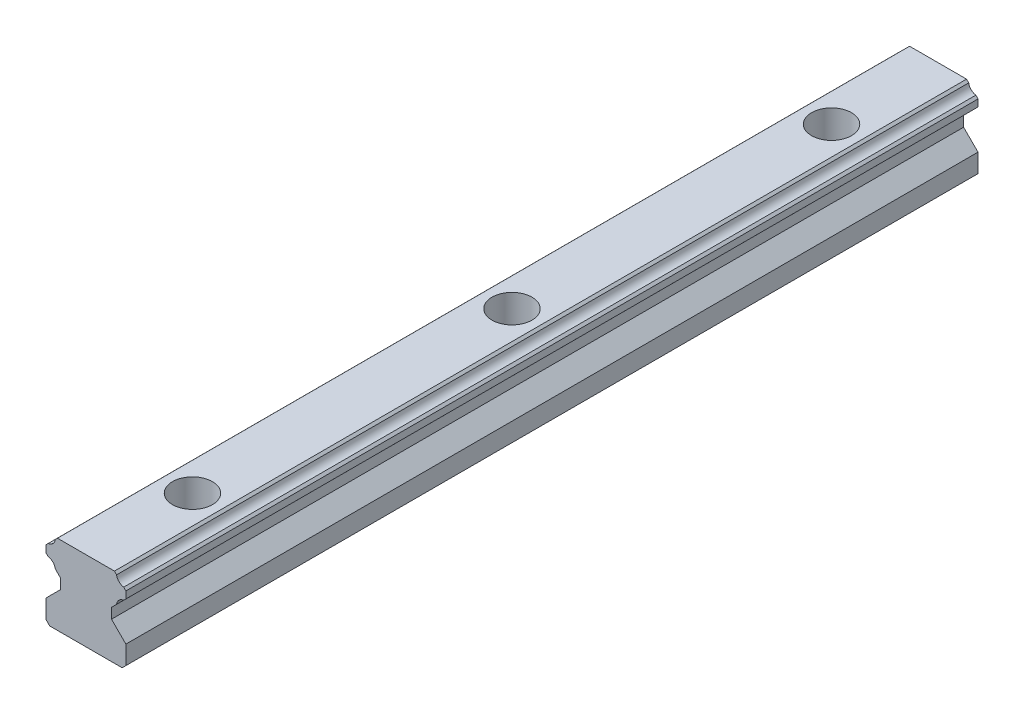
ISO-10303-21;
HEADER;
FILE_DESCRIPTION(('STEP AP214'),'2;1');
FILE_NAME('part.step','',(''),(''),'','','');
FILE_SCHEMA(('AUTOMOTIVE_DESIGN { 1 0 10303 214 1 1 1 1 }'));
ENDSEC;
DATA;
#1=APPLICATION_CONTEXT('core data for automotive mechanical design processes');
#2=APPLICATION_PROTOCOL_DEFINITION('international standard','automotive_design',2000,#1);
#3=PRODUCT_CONTEXT('',#1,'mechanical');
#4=PRODUCT('Part','Part','',(#3));
#5=PRODUCT_RELATED_PRODUCT_CATEGORY('part','',(#4));
#6=PRODUCT_DEFINITION_FORMATION('','',#4);
#7=PRODUCT_DEFINITION_CONTEXT('part definition',#1,'design');
#8=PRODUCT_DEFINITION('design','',#6,#7);
#9=PRODUCT_DEFINITION_SHAPE('','',#8);
#10=(LENGTH_UNIT() NAMED_UNIT(*) SI_UNIT(.MILLI.,.METRE.));
#11=(NAMED_UNIT(*) PLANE_ANGLE_UNIT() SI_UNIT($,.RADIAN.));
#12=(NAMED_UNIT(*) SI_UNIT($,.STERADIAN.) SOLID_ANGLE_UNIT());
#13=UNCERTAINTY_MEASURE_WITH_UNIT(LENGTH_MEASURE(1.E-05),#10,'distance_accuracy_value','');
#14=(GEOMETRIC_REPRESENTATION_CONTEXT(3) GLOBAL_UNCERTAINTY_ASSIGNED_CONTEXT((#13)) GLOBAL_UNIT_ASSIGNED_CONTEXT((#10,
#11,#12)) REPRESENTATION_CONTEXT('',''));
#15=CARTESIAN_POINT('',(0.,0.,0.));
#16=DIRECTION('',(0.,0.,1.));
#17=DIRECTION('',(1.,0.,0.));
#18=AXIS2_PLACEMENT_3D('',#15,#16,#17);
#19=CARTESIAN_POINT('',(5.3500197001096,15.,-160.));
#20=DIRECTION('',(0.,1.,0.));
#21=DIRECTION('',(-1.,0.,0.));
#22=AXIS2_PLACEMENT_3D('',#19,#20,#21);
#23=PLANE('',#22);
#24=CARTESIAN_POINT('',(0.,15.,-80.));
#25=DIRECTION('',(0.,1.,0.));
#26=DIRECTION('',(0.,0.,1.));
#27=AXIS2_PLACEMENT_3D('',#24,#25,#26);
#28=CIRCLE('',#27,3.75000000000001);
#29=CARTESIAN_POINT('',(0.,15.,-76.25));
#30=VERTEX_POINT('',#29);
#31=EDGE_CURVE('E482',#30,#30,#28,.T.);
#32=ORIENTED_EDGE('',*,*,#31,.F.);
#33=EDGE_LOOP('',(#32));
#34=FACE_BOUND('',#33,.T.);
#35=DIRECTION('',(-1.,0.,0.));
#36=VECTOR('',#35,1.);
#37=CARTESIAN_POINT('',(5.3500197001096,15.,0.));
#38=LINE('',#37,#36);
#39=CARTESIAN_POINT('',(5.3500197001096,15.,0.));
#40=VERTEX_POINT('',#39);
#41=CARTESIAN_POINT('',(-5.3500197001096,15.,0.));
#42=VERTEX_POINT('',#41);
#43=EDGE_CURVE('E273',#40,#42,#38,.T.);
#44=ORIENTED_EDGE('',*,*,#43,.F.);
#45=DIRECTION('',(0.,0.,1.));
#46=VECTOR('',#45,1.);
#47=CARTESIAN_POINT('',(5.3500197001096,15.,-160.));
#48=LINE('',#47,#46);
#49=CARTESIAN_POINT('',(5.3500197001096,15.,-160.));
#50=VERTEX_POINT('',#49);
#51=EDGE_CURVE('E315',#50,#40,#48,.T.);
#52=ORIENTED_EDGE('',*,*,#51,.F.);
#53=DIRECTION('',(-1.,0.,0.));
#54=VECTOR('',#53,1.);
#55=CARTESIAN_POINT('',(5.3500197001096,15.,-160.));
#56=LINE('',#55,#54);
#57=CARTESIAN_POINT('',(-5.3500197001096,15.,-160.));
#58=VERTEX_POINT('',#57);
#59=EDGE_CURVE('E535',#50,#58,#56,.T.);
#60=ORIENTED_EDGE('',*,*,#59,.T.);
#61=DIRECTION('',(0.,0.,1.));
#62=VECTOR('',#61,1.);
#63=CARTESIAN_POINT('',(-5.3500197001096,15.,-160.));
#64=LINE('',#63,#62);
#65=EDGE_CURVE('E313',#58,#42,#64,.T.);
#66=ORIENTED_EDGE('',*,*,#65,.T.);
#67=EDGE_LOOP('',(#44,#52,#60,#66));
#68=FACE_BOUND('',#67,.T.);
#69=CARTESIAN_POINT('',(0.,15.,-20.));
#70=DIRECTION('',(0.,1.,0.));
#71=DIRECTION('',(0.,0.,1.));
#72=AXIS2_PLACEMENT_3D('',#69,#70,#71);
#73=CIRCLE('',#72,3.75000000000001);
#74=CARTESIAN_POINT('',(0.,15.,-16.25));
#75=VERTEX_POINT('',#74);
#76=EDGE_CURVE('E234',#75,#75,#73,.T.);
#77=ORIENTED_EDGE('',*,*,#76,.F.);
#78=EDGE_LOOP('',(#77));
#79=FACE_BOUND('',#78,.T.);
#80=CARTESIAN_POINT('',(0.,15.,-140.));
#81=DIRECTION('',(0.,1.,0.));
#82=DIRECTION('',(0.,0.,1.));
#83=AXIS2_PLACEMENT_3D('',#80,#81,#82);
#84=CIRCLE('',#83,3.75000000000001);
#85=CARTESIAN_POINT('',(0.,15.,-136.25));
#86=VERTEX_POINT('',#85);
#87=EDGE_CURVE('E470',#86,#86,#84,.T.);
#88=ORIENTED_EDGE('',*,*,#87,.F.);
#89=EDGE_LOOP('',(#88));
#90=FACE_BOUND('',#89,.T.);
#91=ADVANCED_FACE('F36',(#34,#68,#79,#90),#23,.T.);
#92=CARTESIAN_POINT('',(-6.8000072137317,0.,-160.));
#93=DIRECTION('',(0.,-1.,0.));
#94=DIRECTION('',(1.,0.,0.));
#95=AXIS2_PLACEMENT_3D('',#92,#93,#94);
#96=PLANE('',#95);
#97=CARTESIAN_POINT('',(0.,0.,-80.));
#98=DIRECTION('',(0.,1.,0.));
#99=DIRECTION('',(0.,0.,1.));
#100=AXIS2_PLACEMENT_3D('',#97,#98,#99);
#101=CIRCLE('',#100,2.25);
#102=CARTESIAN_POINT('',(0.,0.,-77.75));
#103=VERTEX_POINT('',#102);
#104=EDGE_CURVE('E473',#103,#103,#101,.T.);
#105=ORIENTED_EDGE('',*,*,#104,.T.);
#106=EDGE_LOOP('',(#105));
#107=FACE_BOUND('',#106,.T.);
#108=DIRECTION('',(1.,0.,0.));
#109=VECTOR('',#108,1.);
#110=CARTESIAN_POINT('',(-6.8000072137317,0.,0.));
#111=LINE('',#110,#109);
#112=CARTESIAN_POINT('',(-6.8000072137317,0.,0.));
#113=VERTEX_POINT('',#112);
#114=CARTESIAN_POINT('',(6.8000072137317,0.,0.));
#115=VERTEX_POINT('',#114);
#116=EDGE_CURVE('E237',#113,#115,#111,.T.);
#117=ORIENTED_EDGE('',*,*,#116,.F.);
#118=DIRECTION('',(0.,0.,1.));
#119=VECTOR('',#118,1.);
#120=CARTESIAN_POINT('',(-6.8000072137317,0.,-160.));
#121=LINE('',#120,#119);
#122=CARTESIAN_POINT('',(-6.8000072137317,0.,-160.));
#123=VERTEX_POINT('',#122);
#124=EDGE_CURVE('E338',#123,#113,#121,.T.);
#125=ORIENTED_EDGE('',*,*,#124,.F.);
#126=DIRECTION('',(1.,0.,0.));
#127=VECTOR('',#126,1.);
#128=CARTESIAN_POINT('',(-6.8000072137317,0.,-160.));
#129=LINE('',#128,#127);
#130=CARTESIAN_POINT('',(6.8000072137317,0.,-160.));
#131=VERTEX_POINT('',#130);
#132=EDGE_CURVE('E499',#123,#131,#129,.T.);
#133=ORIENTED_EDGE('',*,*,#132,.T.);
#134=DIRECTION('',(0.,0.,1.));
#135=VECTOR('',#134,1.);
#136=CARTESIAN_POINT('',(6.8000072137317,0.,-160.));
#137=LINE('',#136,#135);
#138=EDGE_CURVE('E337',#131,#115,#137,.T.);
#139=ORIENTED_EDGE('',*,*,#138,.T.);
#140=EDGE_LOOP('',(#117,#125,#133,#139));
#141=FACE_BOUND('',#140,.T.);
#142=CARTESIAN_POINT('',(0.,0.,-20.));
#143=DIRECTION('',(0.,1.,0.));
#144=DIRECTION('',(0.,0.,1.));
#145=AXIS2_PLACEMENT_3D('',#142,#143,#144);
#146=CIRCLE('',#145,2.25);
#147=CARTESIAN_POINT('',(0.,0.,-17.75));
#148=VERTEX_POINT('',#147);
#149=EDGE_CURVE('E485',#148,#148,#146,.T.);
#150=ORIENTED_EDGE('',*,*,#149,.T.);
#151=EDGE_LOOP('',(#150));
#152=FACE_BOUND('',#151,.T.);
#153=CARTESIAN_POINT('',(0.,0.,-140.));
#154=DIRECTION('',(0.,1.,0.));
#155=DIRECTION('',(0.,0.,1.));
#156=AXIS2_PLACEMENT_3D('',#153,#154,#155);
#157=CIRCLE('',#156,2.25);
#158=CARTESIAN_POINT('',(0.,0.,-137.75));
#159=VERTEX_POINT('',#158);
#160=EDGE_CURVE('E462',#159,#159,#157,.T.);
#161=ORIENTED_EDGE('',*,*,#160,.T.);
#162=EDGE_LOOP('',(#161));
#163=FACE_BOUND('',#162,.T.);
#164=ADVANCED_FACE('F351',(#107,#141,#152,#163),#96,.T.);
#165=CARTESIAN_POINT('',(-7.5,4.2000245999998,-160.));
#166=DIRECTION('',(-1.,0.,0.));
#167=DIRECTION('',(0.,0.,1.));
#168=AXIS2_PLACEMENT_3D('',#165,#166,#167);
#169=PLANE('',#168);
#170=DIRECTION('',(0.,-1.,0.));
#171=VECTOR('',#170,1.);
#172=CARTESIAN_POINT('',(-7.5,4.2000245999998,0.));
#173=LINE('',#172,#171);
#174=CARTESIAN_POINT('',(-7.5,4.2000245999998,0.));
#175=VERTEX_POINT('',#174);
#176=CARTESIAN_POINT('',(-7.5,0.699992710002539,0.));
#177=VERTEX_POINT('',#176);
#178=EDGE_CURVE('E230',#175,#177,#173,.T.);
#179=ORIENTED_EDGE('',*,*,#178,.F.);
#180=DIRECTION('',(0.,0.,1.));
#181=VECTOR('',#180,1.);
#182=CARTESIAN_POINT('',(-7.5,4.2000245999998,-160.));
#183=LINE('',#182,#181);
#184=CARTESIAN_POINT('',(-7.5,4.2000245999998,-160.));
#185=VERTEX_POINT('',#184);
#186=EDGE_CURVE('E11',#185,#175,#183,.T.);
#187=ORIENTED_EDGE('',*,*,#186,.F.);
#188=DIRECTION('',(0.,-1.,0.));
#189=VECTOR('',#188,1.);
#190=CARTESIAN_POINT('',(-7.5,4.2000245999998,-160.));
#191=LINE('',#190,#189);
#192=CARTESIAN_POINT('',(-7.5,0.699992710002539,-160.));
#193=VERTEX_POINT('',#192);
#194=EDGE_CURVE('E299',#185,#193,#191,.T.);
#195=ORIENTED_EDGE('',*,*,#194,.T.);
#196=DIRECTION('',(0.,0.,1.));
#197=VECTOR('',#196,1.);
#198=CARTESIAN_POINT('',(-7.5,0.699992710002539,-160.));
#199=LINE('',#198,#197);
#200=EDGE_CURVE('E40',#193,#177,#199,.T.);
#201=ORIENTED_EDGE('',*,*,#200,.T.);
#202=EDGE_LOOP('',(#179,#187,#195,#201));
#203=FACE_BOUND('',#202,.T.);
#204=ADVANCED_FACE('F38',(#203),#169,.T.);
#205=CARTESIAN_POINT('',(-4.8000182999995,6.9000063000003,-160.));
#206=DIRECTION('',(-0.707106781186548,0.707106781186548,0.));
#207=DIRECTION('',(-0.707106781186548,-0.707106781186548,0.));
#208=AXIS2_PLACEMENT_3D('',#205,#206,#207);
#209=PLANE('',#208);
#210=DIRECTION('',(-0.707106781186548,-0.707106781186548,0.));
#211=VECTOR('',#210,1.);
#212=CARTESIAN_POINT('',(-4.8000182999995,6.9000063000003,0.));
#213=LINE('',#212,#211);
#214=CARTESIAN_POINT('',(-4.8000182999995,6.9000063000003,0.));
#215=VERTEX_POINT('',#214);
#216=EDGE_CURVE('E297',#215,#175,#213,.T.);
#217=ORIENTED_EDGE('',*,*,#216,.F.);
#218=DIRECTION('',(0.,0.,1.));
#219=VECTOR('',#218,1.);
#220=CARTESIAN_POINT('',(-4.8000182999995,6.9000063000003,-160.));
#221=LINE('',#220,#219);
#222=CARTESIAN_POINT('',(-4.8000182999995,6.9000063000003,-160.));
#223=VERTEX_POINT('',#222);
#224=EDGE_CURVE('E46',#223,#215,#221,.T.);
#225=ORIENTED_EDGE('',*,*,#224,.F.);
#226=DIRECTION('',(-0.707106781186548,-0.707106781186548,0.));
#227=VECTOR('',#226,1.);
#228=CARTESIAN_POINT('',(-4.8000182999995,6.9000063000003,-160.));
#229=LINE('',#228,#227);
#230=EDGE_CURVE('E220',#223,#185,#229,.T.);
#231=ORIENTED_EDGE('',*,*,#230,.T.);
#232=ORIENTED_EDGE('',*,*,#186,.T.);
#233=EDGE_LOOP('',(#217,#225,#231,#232));
#234=FACE_BOUND('',#233,.T.);
#235=ADVANCED_FACE('F343',(#234),#209,.T.);
#236=CARTESIAN_POINT('',(-4.8000182999995,8.8400053999999,-160.));
#237=DIRECTION('',(-1.,0.,0.));
#238=DIRECTION('',(0.,0.,1.));
#239=AXIS2_PLACEMENT_3D('',#236,#237,#238);
#240=PLANE('',#239);
#241=DIRECTION('',(0.,-1.,0.));
#242=VECTOR('',#241,1.);
#243=CARTESIAN_POINT('',(-4.8000182999995,8.8400053999999,0.));
#244=LINE('',#243,#242);
#245=CARTESIAN_POINT('',(-4.8000182999995,8.8400053999999,0.));
#246=VERTEX_POINT('',#245);
#247=EDGE_CURVE('E207',#246,#215,#244,.T.);
#248=ORIENTED_EDGE('',*,*,#247,.F.);
#249=DIRECTION('',(0.,0.,1.));
#250=VECTOR('',#249,1.);
#251=CARTESIAN_POINT('',(-4.8000182999995,8.8400053999999,-160.));
#252=LINE('',#251,#250);
#253=CARTESIAN_POINT('',(-4.8000182999995,8.8400053999999,-160.));
#254=VERTEX_POINT('',#253);
#255=EDGE_CURVE('E202',#254,#246,#252,.T.);
#256=ORIENTED_EDGE('',*,*,#255,.F.);
#257=DIRECTION('',(0.,-1.,0.));
#258=VECTOR('',#257,1.);
#259=CARTESIAN_POINT('',(-4.8000182999995,8.8400053999999,-160.));
#260=LINE('',#259,#258);
#261=EDGE_CURVE('E205',#254,#223,#260,.T.);
#262=ORIENTED_EDGE('',*,*,#261,.T.);
#263=ORIENTED_EDGE('',*,*,#224,.T.);
#264=EDGE_LOOP('',(#248,#256,#262,#263));
#265=FACE_BOUND('',#264,.T.);
#266=ADVANCED_FACE('F204',(#265),#240,.T.);
#267=CARTESIAN_POINT('',(-5.7559468125191,9.794179117755,-160.));
#268=DIRECTION('',(-0.706456870044271,-0.707756095535215,0.));
#269=DIRECTION('',(0.707756095535215,-0.706456870044271,0.));
#270=AXIS2_PLACEMENT_3D('',#267,#268,#269);
#271=PLANE('',#270);
#272=DIRECTION('',(0.707756095535215,-0.706456870044271,0.));
#273=VECTOR('',#272,1.);
#274=CARTESIAN_POINT('',(-5.7559468125191,9.794179117755,0.));
#275=LINE('',#274,#273);
#276=CARTESIAN_POINT('',(-5.7559468125191,9.794179117755,0.));
#277=VERTEX_POINT('',#276);
#278=EDGE_CURVE('E294',#277,#246,#275,.T.);
#279=ORIENTED_EDGE('',*,*,#278,.F.);
#280=DIRECTION('',(0.,0.,1.));
#281=VECTOR('',#280,1.);
#282=CARTESIAN_POINT('',(-5.7559468125191,9.794179117755,-160.));
#283=LINE('',#282,#281);
#284=CARTESIAN_POINT('',(-5.7559468125191,9.794179117755,-160.));
#285=VERTEX_POINT('',#284);
#286=EDGE_CURVE('E212',#285,#277,#283,.T.);
#287=ORIENTED_EDGE('',*,*,#286,.F.);
#288=DIRECTION('',(0.707756095535215,-0.706456870044271,0.));
#289=VECTOR('',#288,1.);
#290=CARTESIAN_POINT('',(-5.7559468125191,9.794179117755,-160.));
#291=LINE('',#290,#289);
#292=EDGE_CURVE('E218',#285,#254,#291,.T.);
#293=ORIENTED_EDGE('',*,*,#292,.T.);
#294=ORIENTED_EDGE('',*,*,#255,.T.);
#295=EDGE_LOOP('',(#279,#287,#293,#294));
#296=FACE_BOUND('',#295,.T.);
#297=ADVANCED_FACE('F222',(#296),#271,.T.);
#298=CARTESIAN_POINT('',(-7.30229328109914,9.58823668135776,-160.));
#299=DIRECTION('',(0.,0.,1.));
#300=DIRECTION('',(1.,0.,0.));
#301=AXIS2_PLACEMENT_3D('',#298,#299,#300);
#302=CYLINDRICAL_SURFACE('',#301,1.55999989999974);
#303=CARTESIAN_POINT('',(-7.30229328109914,9.58823668135776,0.));
#304=DIRECTION('',(0.,0.,-1.));
#305=DIRECTION('',(-1.,0.,0.));
#306=AXIS2_PLACEMENT_3D('',#303,#304,#305);
#307=CIRCLE('',#306,1.55999989999974);
#308=CARTESIAN_POINT('',(-7.0943256899454,11.134312089942,0.));
#309=VERTEX_POINT('',#308);
#310=EDGE_CURVE('E291',#309,#277,#307,.T.);
#311=ORIENTED_EDGE('',*,*,#310,.F.);
#312=DIRECTION('',(0.,0.,1.));
#313=VECTOR('',#312,1.);
#314=CARTESIAN_POINT('',(-7.0943256899454,11.134312089942,-160.));
#315=LINE('',#314,#313);
#316=CARTESIAN_POINT('',(-7.0943256899454,11.134312089942,-160.));
#317=VERTEX_POINT('',#316);
#318=EDGE_CURVE('E303',#317,#309,#315,.T.);
#319=ORIENTED_EDGE('',*,*,#318,.F.);
#320=CARTESIAN_POINT('',(-7.30229328109914,9.58823668135776,-160.));
#321=DIRECTION('',(0.,0.,-1.));
#322=DIRECTION('',(-1.,0.,0.));
#323=AXIS2_PLACEMENT_3D('',#320,#321,#322);
#324=CIRCLE('',#323,1.55999989999974);
#325=EDGE_CURVE('E223',#317,#285,#324,.T.);
#326=ORIENTED_EDGE('',*,*,#325,.T.);
#327=ORIENTED_EDGE('',*,*,#286,.T.);
#328=EDGE_LOOP('',(#311,#319,#326,#327));
#329=FACE_BOUND('',#328,.T.);
#330=ADVANCED_FACE('F599',(#329),#302,.F.);
#331=CARTESIAN_POINT('',(-7.5,11.539986599989,-160.));
#332=DIRECTION('',(-0.707106955483918,-0.707106606889134,0.));
#333=DIRECTION('',(0.707106606889134,-0.707106955483918,0.));
#334=AXIS2_PLACEMENT_3D('',#331,#332,#333);
#335=PLANE('',#334);
#336=DIRECTION('',(0.707106606889134,-0.707106955483918,0.));
#337=VECTOR('',#336,1.);
#338=CARTESIAN_POINT('',(-7.5,11.539986599989,0.));
#339=LINE('',#338,#337);
#340=CARTESIAN_POINT('',(-7.5,11.539986599989,0.));
#341=VERTEX_POINT('',#340);
#342=EDGE_CURVE('E288',#341,#309,#339,.T.);
#343=ORIENTED_EDGE('',*,*,#342,.F.);
#344=DIRECTION('',(0.,0.,1.));
#345=VECTOR('',#344,1.);
#346=CARTESIAN_POINT('',(-7.5,11.539986599989,-160.));
#347=LINE('',#346,#345);
#348=CARTESIAN_POINT('',(-7.5,11.539986599989,-160.));
#349=VERTEX_POINT('',#348);
#350=EDGE_CURVE('E305',#349,#341,#347,.T.);
#351=ORIENTED_EDGE('',*,*,#350,.F.);
#352=DIRECTION('',(0.707106606889134,-0.707106955483918,0.));
#353=VECTOR('',#352,1.);
#354=CARTESIAN_POINT('',(-7.5,11.539986599989,-160.));
#355=LINE('',#354,#353);
#356=EDGE_CURVE('E225',#349,#317,#355,.T.);
#357=ORIENTED_EDGE('',*,*,#356,.T.);
#358=ORIENTED_EDGE('',*,*,#318,.T.);
#359=EDGE_LOOP('',(#343,#351,#357,#358));
#360=FACE_BOUND('',#359,.T.);
#361=ADVANCED_FACE('F553',(#360),#335,.T.);
#362=CARTESIAN_POINT('',(-7.5,12.850020399955,-160.));
#363=DIRECTION('',(-1.,0.,0.));
#364=DIRECTION('',(0.,0.,1.));
#365=AXIS2_PLACEMENT_3D('',#362,#363,#364);
#366=PLANE('',#365);
#367=DIRECTION('',(0.,-1.,0.));
#368=VECTOR('',#367,1.);
#369=CARTESIAN_POINT('',(-7.5,12.850020399955,0.));
#370=LINE('',#369,#368);
#371=CARTESIAN_POINT('',(-7.5,12.850020399955,0.));
#372=VERTEX_POINT('',#371);
#373=EDGE_CURVE('E285',#372,#341,#370,.T.);
#374=ORIENTED_EDGE('',*,*,#373,.F.);
#375=DIRECTION('',(0.,0.,1.));
#376=VECTOR('',#375,1.);
#377=CARTESIAN_POINT('',(-7.5,12.850020399955,-160.));
#378=LINE('',#377,#376);
#379=CARTESIAN_POINT('',(-7.5,12.850020399955,-160.));
#380=VERTEX_POINT('',#379);
#381=EDGE_CURVE('E307',#380,#372,#378,.T.);
#382=ORIENTED_EDGE('',*,*,#381,.F.);
#383=DIRECTION('',(0.,-1.,0.));
#384=VECTOR('',#383,1.);
#385=CARTESIAN_POINT('',(-7.5,12.850020399955,-160.));
#386=LINE('',#385,#384);
#387=EDGE_CURVE('E547',#380,#349,#386,.T.);
#388=ORIENTED_EDGE('',*,*,#387,.T.);
#389=ORIENTED_EDGE('',*,*,#350,.T.);
#390=EDGE_LOOP('',(#374,#382,#388,#389));
#391=FACE_BOUND('',#390,.T.);
#392=ADVANCED_FACE('F559',(#391),#366,.T.);
#393=CARTESIAN_POINT('',(-7.0943256899454,13.268442750921,-160.));
#394=DIRECTION('',(-0.717959196634107,0.696085190166051,0.));
#395=DIRECTION('',(-0.696085190166051,-0.717959196634107,0.));
#396=AXIS2_PLACEMENT_3D('',#393,#394,#395);
#397=PLANE('',#396);
#398=DIRECTION('',(-0.696085190166051,-0.717959196634107,0.));
#399=VECTOR('',#398,1.);
#400=CARTESIAN_POINT('',(-7.0943256899454,13.268442750921,0.));
#401=LINE('',#400,#399);
#402=CARTESIAN_POINT('',(-7.0943256899454,13.268442750921,0.));
#403=VERTEX_POINT('',#402);
#404=EDGE_CURVE('E282',#403,#372,#401,.T.);
#405=ORIENTED_EDGE('',*,*,#404,.F.);
#406=DIRECTION('',(0.,0.,1.));
#407=VECTOR('',#406,1.);
#408=CARTESIAN_POINT('',(-7.0943256899454,13.268442750921,-160.));
#409=LINE('',#408,#407);
#410=CARTESIAN_POINT('',(-7.0943256899454,13.268442750921,-160.));
#411=VERTEX_POINT('',#410);
#412=EDGE_CURVE('E309',#411,#403,#409,.T.);
#413=ORIENTED_EDGE('',*,*,#412,.F.);
#414=DIRECTION('',(-0.696085190166051,-0.717959196634107,0.));
#415=VECTOR('',#414,1.);
#416=CARTESIAN_POINT('',(-7.0943256899454,13.268442750921,-160.));
#417=LINE('',#416,#415);
#418=EDGE_CURVE('E544',#411,#380,#417,.T.);
#419=ORIENTED_EDGE('',*,*,#418,.T.);
#420=ORIENTED_EDGE('',*,*,#381,.T.);
#421=EDGE_LOOP('',(#405,#413,#419,#420));
#422=FACE_BOUND('',#421,.T.);
#423=ADVANCED_FACE('F562',(#422),#397,.T.);
#424=CARTESIAN_POINT('',(-7.30025219070474,14.8147913417259,-160.));
#425=DIRECTION('',(0.,0.,1.));
#426=DIRECTION('',(1.,0.,0.));
#427=AXIS2_PLACEMENT_3D('',#424,#425,#426);
#428=CYLINDRICAL_SURFACE('',#427,1.55999989999974);
#429=CARTESIAN_POINT('',(-7.30025219070474,14.8147913417259,0.));
#430=DIRECTION('',(0.,0.,-1.));
#431=DIRECTION('',(-1.,0.,0.));
#432=AXIS2_PLACEMENT_3D('',#429,#430,#431);
#433=CIRCLE('',#432,1.55999989999974);
#434=CARTESIAN_POINT('',(-5.7559468125191,14.594063937659,0.));
#435=VERTEX_POINT('',#434);
#436=EDGE_CURVE('E279',#435,#403,#433,.T.);
#437=ORIENTED_EDGE('',*,*,#436,.F.);
#438=DIRECTION('',(0.,0.,1.));
#439=VECTOR('',#438,1.);
#440=CARTESIAN_POINT('',(-5.7559468125191,14.594063937659,-160.));
#441=LINE('',#440,#439);
#442=CARTESIAN_POINT('',(-5.7559468125191,14.594063937659,-160.));
#443=VERTEX_POINT('',#442);
#444=EDGE_CURVE('E311',#443,#435,#441,.T.);
#445=ORIENTED_EDGE('',*,*,#444,.F.);
#446=CARTESIAN_POINT('',(-7.30025219070474,14.8147913417259,-160.));
#447=DIRECTION('',(0.,0.,-1.));
#448=DIRECTION('',(-1.,0.,0.));
#449=AXIS2_PLACEMENT_3D('',#446,#447,#448);
#450=CIRCLE('',#449,1.55999989999974);
#451=EDGE_CURVE('E541',#443,#411,#450,.T.);
#452=ORIENTED_EDGE('',*,*,#451,.T.);
#453=ORIENTED_EDGE('',*,*,#412,.T.);
#454=EDGE_LOOP('',(#437,#445,#452,#453));
#455=FACE_BOUND('',#454,.T.);
#456=ADVANCED_FACE('F567',(#455),#428,.F.);
#457=CARTESIAN_POINT('',(-5.3500197001096,15.,-160.));
#458=DIRECTION('',(-0.70711457624681,0.707098986040352,0.));
#459=DIRECTION('',(-0.707098986040352,-0.70711457624681,0.));
#460=AXIS2_PLACEMENT_3D('',#457,#458,#459);
#461=PLANE('',#460);
#462=DIRECTION('',(-0.707098986040352,-0.70711457624681,0.));
#463=VECTOR('',#462,1.);
#464=CARTESIAN_POINT('',(-5.3500197001096,15.,0.));
#465=LINE('',#464,#463);
#466=EDGE_CURVE('E276',#42,#435,#465,.T.);
#467=ORIENTED_EDGE('',*,*,#466,.F.);
#468=ORIENTED_EDGE('',*,*,#65,.F.);
#469=DIRECTION('',(-0.707098986040352,-0.70711457624681,0.));
#470=VECTOR('',#469,1.);
#471=CARTESIAN_POINT('',(-5.3500197001096,15.,-160.));
#472=LINE('',#471,#470);
#473=EDGE_CURVE('E538',#58,#443,#472,.T.);
#474=ORIENTED_EDGE('',*,*,#473,.T.);
#475=ORIENTED_EDGE('',*,*,#444,.T.);
#476=EDGE_LOOP('',(#467,#468,#474,#475));
#477=FACE_BOUND('',#476,.T.);
#478=ADVANCED_FACE('F365',(#477),#461,.T.);
#479=CARTESIAN_POINT('',(5.3500197001096,15.,-160.));
#480=DIRECTION('',(0.707114576246815,0.707098986040348,0.));
#481=DIRECTION('',(-0.707098986040348,0.707114576246815,0.));
#482=AXIS2_PLACEMENT_3D('',#479,#480,#481);
#483=PLANE('',#482);
#484=DIRECTION('',(-0.707098986040348,0.707114576246815,0.));
#485=VECTOR('',#484,1.);
#486=CARTESIAN_POINT('',(5.3500197001096,15.,0.));
#487=LINE('',#486,#485);
#488=CARTESIAN_POINT('',(5.75594681251909,14.594063937659,0.));
#489=VERTEX_POINT('',#488);
#490=EDGE_CURVE('E270',#489,#40,#487,.T.);
#491=ORIENTED_EDGE('',*,*,#490,.F.);
#492=DIRECTION('',(0.,0.,1.));
#493=VECTOR('',#492,1.);
#494=CARTESIAN_POINT('',(5.75594681251909,14.594063937659,-160.));
#495=LINE('',#494,#493);
#496=CARTESIAN_POINT('',(5.75594681251909,14.594063937659,-160.));
#497=VERTEX_POINT('',#496);
#498=EDGE_CURVE('E317',#497,#489,#495,.T.);
#499=ORIENTED_EDGE('',*,*,#498,.F.);
#500=DIRECTION('',(-0.707098986040348,0.707114576246815,0.));
#501=VECTOR('',#500,1.);
#502=CARTESIAN_POINT('',(5.3500197001096,15.,-160.));
#503=LINE('',#502,#501);
#504=EDGE_CURVE('E532',#497,#50,#503,.T.);
#505=ORIENTED_EDGE('',*,*,#504,.T.);
#506=ORIENTED_EDGE('',*,*,#51,.T.);
#507=EDGE_LOOP('',(#491,#499,#505,#506));
#508=FACE_BOUND('',#507,.T.);
#509=ADVANCED_FACE('F367',(#508),#483,.T.);
#510=CARTESIAN_POINT('',(7.30025219070473,14.8147913417259,-160.));
#511=DIRECTION('',(0.,0.,1.));
#512=DIRECTION('',(1.,0.,0.));
#513=AXIS2_PLACEMENT_3D('',#510,#511,#512);
#514=CYLINDRICAL_SURFACE('',#513,1.55999989999974);
#515=CARTESIAN_POINT('',(7.30025219070473,14.8147913417259,0.));
#516=DIRECTION('',(0.,0.,-1.));
#517=DIRECTION('',(1.,0.,0.));
#518=AXIS2_PLACEMENT_3D('',#515,#516,#517);
#519=CIRCLE('',#518,1.55999989999974);
#520=CARTESIAN_POINT('',(7.09432568994539,13.268442750921,0.));
#521=VERTEX_POINT('',#520);
#522=EDGE_CURVE('E267',#521,#489,#519,.T.);
#523=ORIENTED_EDGE('',*,*,#522,.F.);
#524=DIRECTION('',(0.,0.,1.));
#525=VECTOR('',#524,1.);
#526=CARTESIAN_POINT('',(7.09432568994539,13.268442750921,-160.));
#527=LINE('',#526,#525);
#528=CARTESIAN_POINT('',(7.09432568994539,13.268442750921,-160.));
#529=VERTEX_POINT('',#528);
#530=EDGE_CURVE('E319',#529,#521,#527,.T.);
#531=ORIENTED_EDGE('',*,*,#530,.F.);
#532=CARTESIAN_POINT('',(7.30025219070473,14.8147913417259,-160.));
#533=DIRECTION('',(0.,0.,-1.));
#534=DIRECTION('',(1.,0.,0.));
#535=AXIS2_PLACEMENT_3D('',#532,#533,#534);
#536=CIRCLE('',#535,1.55999989999974);
#537=EDGE_CURVE('E529',#529,#497,#536,.T.);
#538=ORIENTED_EDGE('',*,*,#537,.T.);
#539=ORIENTED_EDGE('',*,*,#498,.T.);
#540=EDGE_LOOP('',(#523,#531,#538,#539));
#541=FACE_BOUND('',#540,.T.);
#542=ADVANCED_FACE('F370',(#541),#514,.F.);
#543=CARTESIAN_POINT('',(7.09432568994539,13.268442750921,-160.));
#544=DIRECTION('',(0.717959196634104,0.696085190166054,0.));
#545=DIRECTION('',(-0.696085190166054,0.717959196634104,0.));
#546=AXIS2_PLACEMENT_3D('',#543,#544,#545);
#547=PLANE('',#546);
#548=DIRECTION('',(-0.696085190166054,0.717959196634104,0.));
#549=VECTOR('',#548,1.);
#550=CARTESIAN_POINT('',(7.09432568994539,13.268442750921,0.));
#551=LINE('',#550,#549);
#552=CARTESIAN_POINT('',(7.5,12.850020399955,0.));
#553=VERTEX_POINT('',#552);
#554=EDGE_CURVE('E264',#553,#521,#551,.T.);
#555=ORIENTED_EDGE('',*,*,#554,.F.);
#556=DIRECTION('',(0.,0.,1.));
#557=VECTOR('',#556,1.);
#558=CARTESIAN_POINT('',(7.5,12.850020399955,-160.));
#559=LINE('',#558,#557);
#560=CARTESIAN_POINT('',(7.5,12.850020399955,-160.));
#561=VERTEX_POINT('',#560);
#562=EDGE_CURVE('E321',#561,#553,#559,.T.);
#563=ORIENTED_EDGE('',*,*,#562,.F.);
#564=DIRECTION('',(-0.696085190166054,0.717959196634104,0.));
#565=VECTOR('',#564,1.);
#566=CARTESIAN_POINT('',(7.09432568994539,13.268442750921,-160.));
#567=LINE('',#566,#565);
#568=EDGE_CURVE('E526',#561,#529,#567,.T.);
#569=ORIENTED_EDGE('',*,*,#568,.T.);
#570=ORIENTED_EDGE('',*,*,#530,.T.);
#571=EDGE_LOOP('',(#555,#563,#569,#570));
#572=FACE_BOUND('',#571,.T.);
#573=ADVANCED_FACE('F374',(#572),#547,.T.);
#574=CARTESIAN_POINT('',(7.5,12.850020399955,-160.));
#575=DIRECTION('',(1.,0.,0.));
#576=DIRECTION('',(0.,0.,-1.));
#577=AXIS2_PLACEMENT_3D('',#574,#575,#576);
#578=PLANE('',#577);
#579=DIRECTION('',(0.,1.,0.));
#580=VECTOR('',#579,1.);
#581=CARTESIAN_POINT('',(7.5,12.850020399955,0.));
#582=LINE('',#581,#580);
#583=CARTESIAN_POINT('',(7.5,11.539986599989,0.));
#584=VERTEX_POINT('',#583);
#585=EDGE_CURVE('E261',#584,#553,#582,.T.);
#586=ORIENTED_EDGE('',*,*,#585,.F.);
#587=DIRECTION('',(0.,0.,1.));
#588=VECTOR('',#587,1.);
#589=CARTESIAN_POINT('',(7.5,11.539986599989,-160.));
#590=LINE('',#589,#588);
#591=CARTESIAN_POINT('',(7.5,11.539986599989,-160.));
#592=VERTEX_POINT('',#591);
#593=EDGE_CURVE('E323',#592,#584,#590,.T.);
#594=ORIENTED_EDGE('',*,*,#593,.F.);
#595=DIRECTION('',(0.,1.,0.));
#596=VECTOR('',#595,1.);
#597=CARTESIAN_POINT('',(7.5,12.850020399955,-160.));
#598=LINE('',#597,#596);
#599=EDGE_CURVE('E523',#592,#561,#598,.T.);
#600=ORIENTED_EDGE('',*,*,#599,.T.);
#601=ORIENTED_EDGE('',*,*,#562,.T.);
#602=EDGE_LOOP('',(#586,#594,#600,#601));
#603=FACE_BOUND('',#602,.T.);
#604=ADVANCED_FACE('F378',(#603),#578,.T.);
#605=CARTESIAN_POINT('',(7.5,11.539986599989,-160.));
#606=DIRECTION('',(0.707106955483915,-0.707106606889138,0.));
#607=DIRECTION('',(0.707106606889138,0.707106955483915,0.));
#608=AXIS2_PLACEMENT_3D('',#605,#606,#607);
#609=PLANE('',#608);
#610=DIRECTION('',(0.707106606889138,0.707106955483915,0.));
#611=VECTOR('',#610,1.);
#612=CARTESIAN_POINT('',(7.5,11.539986599989,0.));
#613=LINE('',#612,#611);
#614=CARTESIAN_POINT('',(7.09432568994539,11.134312089942,0.));
#615=VERTEX_POINT('',#614);
#616=EDGE_CURVE('E258',#615,#584,#613,.T.);
#617=ORIENTED_EDGE('',*,*,#616,.F.);
#618=DIRECTION('',(0.,0.,1.));
#619=VECTOR('',#618,1.);
#620=CARTESIAN_POINT('',(7.09432568994539,11.134312089942,-160.));
#621=LINE('',#620,#619);
#622=CARTESIAN_POINT('',(7.09432568994539,11.134312089942,-160.));
#623=VERTEX_POINT('',#622);
#624=EDGE_CURVE('E325',#623,#615,#621,.T.);
#625=ORIENTED_EDGE('',*,*,#624,.F.);
#626=DIRECTION('',(0.707106606889138,0.707106955483915,0.));
#627=VECTOR('',#626,1.);
#628=CARTESIAN_POINT('',(7.5,11.539986599989,-160.));
#629=LINE('',#628,#627);
#630=EDGE_CURVE('E520',#623,#592,#629,.T.);
#631=ORIENTED_EDGE('',*,*,#630,.T.);
#632=ORIENTED_EDGE('',*,*,#593,.T.);
#633=EDGE_LOOP('',(#617,#625,#631,#632));
#634=FACE_BOUND('',#633,.T.);
#635=ADVANCED_FACE('F382',(#634),#609,.T.);
#636=CARTESIAN_POINT('',(7.30229328109913,9.58823668135777,-160.));
#637=DIRECTION('',(0.,0.,1.));
#638=DIRECTION('',(1.,0.,0.));
#639=AXIS2_PLACEMENT_3D('',#636,#637,#638);
#640=CYLINDRICAL_SURFACE('',#639,1.55999989999974);
#641=CARTESIAN_POINT('',(7.30229328109913,9.58823668135777,0.));
#642=DIRECTION('',(0.,0.,-1.));
#643=DIRECTION('',(1.,0.,0.));
#644=AXIS2_PLACEMENT_3D('',#641,#642,#643);
#645=CIRCLE('',#644,1.55999989999974);
#646=CARTESIAN_POINT('',(5.7559468125191,9.794179117755,0.));
#647=VERTEX_POINT('',#646);
#648=EDGE_CURVE('E255',#647,#615,#645,.T.);
#649=ORIENTED_EDGE('',*,*,#648,.F.);
#650=DIRECTION('',(0.,0.,1.));
#651=VECTOR('',#650,1.);
#652=CARTESIAN_POINT('',(5.7559468125191,9.794179117755,-160.));
#653=LINE('',#652,#651);
#654=CARTESIAN_POINT('',(5.7559468125191,9.794179117755,-160.));
#655=VERTEX_POINT('',#654);
#656=EDGE_CURVE('E327',#655,#647,#653,.T.);
#657=ORIENTED_EDGE('',*,*,#656,.F.);
#658=CARTESIAN_POINT('',(7.30229328109913,9.58823668135777,-160.));
#659=DIRECTION('',(0.,0.,-1.));
#660=DIRECTION('',(1.,0.,0.));
#661=AXIS2_PLACEMENT_3D('',#658,#659,#660);
#662=CIRCLE('',#661,1.55999989999974);
#663=EDGE_CURVE('E517',#655,#623,#662,.T.);
#664=ORIENTED_EDGE('',*,*,#663,.T.);
#665=ORIENTED_EDGE('',*,*,#624,.T.);
#666=EDGE_LOOP('',(#649,#657,#664,#665));
#667=FACE_BOUND('',#666,.T.);
#668=ADVANCED_FACE('F386',(#667),#640,.F.);
#669=CARTESIAN_POINT('',(5.7559468125191,9.794179117755,-160.));
#670=DIRECTION('',(0.706456870044271,-0.707756095535214,0.));
#671=DIRECTION('',(0.707756095535214,0.706456870044271,0.));
#672=AXIS2_PLACEMENT_3D('',#669,#670,#671);
#673=PLANE('',#672);
#674=DIRECTION('',(0.707756095535214,0.706456870044271,0.));
#675=VECTOR('',#674,1.);
#676=CARTESIAN_POINT('',(5.7559468125191,9.794179117755,0.));
#677=LINE('',#676,#675);
#678=CARTESIAN_POINT('',(4.8000182999995,8.8400053999999,0.));
#679=VERTEX_POINT('',#678);
#680=EDGE_CURVE('E252',#679,#647,#677,.T.);
#681=ORIENTED_EDGE('',*,*,#680,.F.);
#682=DIRECTION('',(0.,0.,1.));
#683=VECTOR('',#682,1.);
#684=CARTESIAN_POINT('',(4.8000182999995,8.8400053999999,-160.));
#685=LINE('',#684,#683);
#686=CARTESIAN_POINT('',(4.8000182999995,8.8400053999999,-160.));
#687=VERTEX_POINT('',#686);
#688=EDGE_CURVE('E329',#687,#679,#685,.T.);
#689=ORIENTED_EDGE('',*,*,#688,.F.);
#690=DIRECTION('',(0.707756095535214,0.706456870044271,0.));
#691=VECTOR('',#690,1.);
#692=CARTESIAN_POINT('',(5.7559468125191,9.794179117755,-160.));
#693=LINE('',#692,#691);
#694=EDGE_CURVE('E514',#687,#655,#693,.T.);
#695=ORIENTED_EDGE('',*,*,#694,.T.);
#696=ORIENTED_EDGE('',*,*,#656,.T.);
#697=EDGE_LOOP('',(#681,#689,#695,#696));
#698=FACE_BOUND('',#697,.T.);
#699=ADVANCED_FACE('F390',(#698),#673,.T.);
#700=CARTESIAN_POINT('',(4.8000182999995,8.8400053999999,-160.));
#701=DIRECTION('',(1.,0.,0.));
#702=DIRECTION('',(0.,0.,-1.));
#703=AXIS2_PLACEMENT_3D('',#700,#701,#702);
#704=PLANE('',#703);
#705=DIRECTION('',(0.,1.,0.));
#706=VECTOR('',#705,1.);
#707=CARTESIAN_POINT('',(4.8000182999995,8.8400053999999,0.));
#708=LINE('',#707,#706);
#709=CARTESIAN_POINT('',(4.8000182999995,6.9000063000003,0.));
#710=VERTEX_POINT('',#709);
#711=EDGE_CURVE('E249',#710,#679,#708,.T.);
#712=ORIENTED_EDGE('',*,*,#711,.F.);
#713=DIRECTION('',(0.,0.,1.));
#714=VECTOR('',#713,1.);
#715=CARTESIAN_POINT('',(4.8000182999995,6.9000063000003,-160.));
#716=LINE('',#715,#714);
#717=CARTESIAN_POINT('',(4.8000182999995,6.9000063000003,-160.));
#718=VERTEX_POINT('',#717);
#719=EDGE_CURVE('E331',#718,#710,#716,.T.);
#720=ORIENTED_EDGE('',*,*,#719,.F.);
#721=DIRECTION('',(0.,1.,0.));
#722=VECTOR('',#721,1.);
#723=CARTESIAN_POINT('',(4.8000182999995,8.8400053999999,-160.));
#724=LINE('',#723,#722);
#725=EDGE_CURVE('E511',#718,#687,#724,.T.);
#726=ORIENTED_EDGE('',*,*,#725,.T.);
#727=ORIENTED_EDGE('',*,*,#688,.T.);
#728=EDGE_LOOP('',(#712,#720,#726,#727));
#729=FACE_BOUND('',#728,.T.);
#730=ADVANCED_FACE('F394',(#729),#704,.T.);
#731=CARTESIAN_POINT('',(4.8000182999995,6.9000063000003,-160.));
#732=DIRECTION('',(0.707106781186548,0.707106781186548,0.));
#733=DIRECTION('',(-0.707106781186548,0.707106781186548,0.));
#734=AXIS2_PLACEMENT_3D('',#731,#732,#733);
#735=PLANE('',#734);
#736=DIRECTION('',(-0.707106781186548,0.707106781186548,0.));
#737=VECTOR('',#736,1.);
#738=CARTESIAN_POINT('',(4.8000182999995,6.9000063000003,0.));
#739=LINE('',#738,#737);
#740=CARTESIAN_POINT('',(7.5,4.2000245999998,0.));
#741=VERTEX_POINT('',#740);
#742=EDGE_CURVE('E246',#741,#710,#739,.T.);
#743=ORIENTED_EDGE('',*,*,#742,.F.);
#744=DIRECTION('',(0.,0.,1.));
#745=VECTOR('',#744,1.);
#746=CARTESIAN_POINT('',(7.5,4.2000245999998,-160.));
#747=LINE('',#746,#745);
#748=CARTESIAN_POINT('',(7.5,4.2000245999998,-160.));
#749=VERTEX_POINT('',#748);
#750=EDGE_CURVE('E333',#749,#741,#747,.T.);
#751=ORIENTED_EDGE('',*,*,#750,.F.);
#752=DIRECTION('',(-0.707106781186548,0.707106781186548,0.));
#753=VECTOR('',#752,1.);
#754=CARTESIAN_POINT('',(4.8000182999995,6.9000063000003,-160.));
#755=LINE('',#754,#753);
#756=EDGE_CURVE('E508',#749,#718,#755,.T.);
#757=ORIENTED_EDGE('',*,*,#756,.T.);
#758=ORIENTED_EDGE('',*,*,#719,.T.);
#759=EDGE_LOOP('',(#743,#751,#757,#758));
#760=FACE_BOUND('',#759,.T.);
#761=ADVANCED_FACE('F398',(#760),#735,.T.);
#762=CARTESIAN_POINT('',(7.5,4.2000245999998,-160.));
#763=DIRECTION('',(1.,0.,0.));
#764=DIRECTION('',(0.,1.,0.));
#765=AXIS2_PLACEMENT_3D('',#762,#763,#764);
#766=PLANE('',#765);
#767=DIRECTION('',(0.,1.,0.));
#768=VECTOR('',#767,1.);
#769=CARTESIAN_POINT('',(7.5,4.2000245999998,0.));
#770=LINE('',#769,#768);
#771=CARTESIAN_POINT('',(7.5,0.699992710002543,0.));
#772=VERTEX_POINT('',#771);
#773=EDGE_CURVE('E243',#772,#741,#770,.T.);
#774=ORIENTED_EDGE('',*,*,#773,.F.);
#775=DIRECTION('',(0.,0.,1.));
#776=VECTOR('',#775,1.);
#777=CARTESIAN_POINT('',(7.5,0.699992710002543,-160.));
#778=LINE('',#777,#776);
#779=CARTESIAN_POINT('',(7.5,0.699992710002543,-160.));
#780=VERTEX_POINT('',#779);
#781=EDGE_CURVE('E335',#780,#772,#778,.T.);
#782=ORIENTED_EDGE('',*,*,#781,.F.);
#783=DIRECTION('',(0.,1.,0.));
#784=VECTOR('',#783,1.);
#785=CARTESIAN_POINT('',(7.5,4.2000245999998,-160.));
#786=LINE('',#785,#784);
#787=EDGE_CURVE('E505',#780,#749,#786,.T.);
#788=ORIENTED_EDGE('',*,*,#787,.T.);
#789=ORIENTED_EDGE('',*,*,#750,.T.);
#790=EDGE_LOOP('',(#774,#782,#788,#789));
#791=FACE_BOUND('',#790,.T.);
#792=ADVANCED_FACE('F402',(#791),#766,.T.);
#793=CARTESIAN_POINT('',(7.5,0.699992710002543,-160.));
#794=DIRECTION('',(0.707106742666124,-0.707106819706969,0.));
#795=DIRECTION('',(0.707106819706969,0.707106742666124,0.));
#796=AXIS2_PLACEMENT_3D('',#793,#794,#795);
#797=PLANE('',#796);
#798=DIRECTION('',(0.707106819706969,0.707106742666124,0.));
#799=VECTOR('',#798,1.);
#800=CARTESIAN_POINT('',(7.5,0.699992710002543,0.));
#801=LINE('',#800,#799);
#802=EDGE_CURVE('E240',#115,#772,#801,.T.);
#803=ORIENTED_EDGE('',*,*,#802,.F.);
#804=ORIENTED_EDGE('',*,*,#138,.F.);
#805=DIRECTION('',(0.707106819706969,0.707106742666124,0.));
#806=VECTOR('',#805,1.);
#807=CARTESIAN_POINT('',(7.5,0.699992710002543,-160.));
#808=LINE('',#807,#806);
#809=EDGE_CURVE('E502',#131,#780,#808,.T.);
#810=ORIENTED_EDGE('',*,*,#809,.T.);
#811=ORIENTED_EDGE('',*,*,#781,.T.);
#812=EDGE_LOOP('',(#803,#804,#810,#811));
#813=FACE_BOUND('',#812,.T.);
#814=ADVANCED_FACE('F406',(#813),#797,.T.);
#815=CARTESIAN_POINT('',(-7.5,0.699992710002539,-160.));
#816=DIRECTION('',(-0.707106742666121,-0.707106819706972,0.));
#817=DIRECTION('',(0.707106819706972,-0.707106742666121,0.));
#818=AXIS2_PLACEMENT_3D('',#815,#816,#817);
#819=PLANE('',#818);
#820=DIRECTION('',(0.707106819706972,-0.707106742666121,0.));
#821=VECTOR('',#820,1.);
#822=CARTESIAN_POINT('',(-7.5,0.699992710002539,0.));
#823=LINE('',#822,#821);
#824=EDGE_CURVE('E233',#177,#113,#823,.T.);
#825=ORIENTED_EDGE('',*,*,#824,.F.);
#826=ORIENTED_EDGE('',*,*,#200,.F.);
#827=DIRECTION('',(0.707106819706972,-0.707106742666121,0.));
#828=VECTOR('',#827,1.);
#829=CARTESIAN_POINT('',(-7.5,0.699992710002539,-160.));
#830=LINE('',#829,#828);
#831=EDGE_CURVE('E497',#193,#123,#830,.T.);
#832=ORIENTED_EDGE('',*,*,#831,.T.);
#833=ORIENTED_EDGE('',*,*,#124,.T.);
#834=EDGE_LOOP('',(#825,#826,#832,#833));
#835=FACE_BOUND('',#834,.T.);
#836=ADVANCED_FACE('F340',(#835),#819,.T.);
#837=CARTESIAN_POINT('',(7.30229328109913,9.58823668135777,-160.));
#838=DIRECTION('',(0.,0.,1.));
#839=DIRECTION('',(1.,0.,0.));
#840=AXIS2_PLACEMENT_3D('',#837,#838,#839);
#841=PLANE('',#840);
#842=ORIENTED_EDGE('',*,*,#194,.F.);
#843=ORIENTED_EDGE('',*,*,#230,.F.);
#844=ORIENTED_EDGE('',*,*,#261,.F.);
#845=ORIENTED_EDGE('',*,*,#292,.F.);
#846=ORIENTED_EDGE('',*,*,#325,.F.);
#847=ORIENTED_EDGE('',*,*,#356,.F.);
#848=ORIENTED_EDGE('',*,*,#387,.F.);
#849=ORIENTED_EDGE('',*,*,#418,.F.);
#850=ORIENTED_EDGE('',*,*,#451,.F.);
#851=ORIENTED_EDGE('',*,*,#473,.F.);
#852=ORIENTED_EDGE('',*,*,#59,.F.);
#853=ORIENTED_EDGE('',*,*,#504,.F.);
#854=ORIENTED_EDGE('',*,*,#537,.F.);
#855=ORIENTED_EDGE('',*,*,#568,.F.);
#856=ORIENTED_EDGE('',*,*,#599,.F.);
#857=ORIENTED_EDGE('',*,*,#630,.F.);
#858=ORIENTED_EDGE('',*,*,#663,.F.);
#859=ORIENTED_EDGE('',*,*,#694,.F.);
#860=ORIENTED_EDGE('',*,*,#725,.F.);
#861=ORIENTED_EDGE('',*,*,#756,.F.);
#862=ORIENTED_EDGE('',*,*,#787,.F.);
#863=ORIENTED_EDGE('',*,*,#809,.F.);
#864=ORIENTED_EDGE('',*,*,#132,.F.);
#865=ORIENTED_EDGE('',*,*,#831,.F.);
#866=EDGE_LOOP('',(#842,#843,#844,#845,#846,#847,#848,#849,#850,#851,#852,#853,#854,#855,#856,
#857,#858,#859,#860,#861,#862,#863,#864,#865));
#867=FACE_BOUND('',#866,.T.);
#868=ADVANCED_FACE('F216',(#867),#841,.F.);
#869=CARTESIAN_POINT('',(7.30229328109913,9.58823668135777,0.));
#870=DIRECTION('',(0.,0.,1.));
#871=DIRECTION('',(1.,0.,0.));
#872=AXIS2_PLACEMENT_3D('',#869,#870,#871);
#873=PLANE('',#872);
#874=ORIENTED_EDGE('',*,*,#178,.T.);
#875=ORIENTED_EDGE('',*,*,#824,.T.);
#876=ORIENTED_EDGE('',*,*,#116,.T.);
#877=ORIENTED_EDGE('',*,*,#802,.T.);
#878=ORIENTED_EDGE('',*,*,#773,.T.);
#879=ORIENTED_EDGE('',*,*,#742,.T.);
#880=ORIENTED_EDGE('',*,*,#711,.T.);
#881=ORIENTED_EDGE('',*,*,#680,.T.);
#882=ORIENTED_EDGE('',*,*,#648,.T.);
#883=ORIENTED_EDGE('',*,*,#616,.T.);
#884=ORIENTED_EDGE('',*,*,#585,.T.);
#885=ORIENTED_EDGE('',*,*,#554,.T.);
#886=ORIENTED_EDGE('',*,*,#522,.T.);
#887=ORIENTED_EDGE('',*,*,#490,.T.);
#888=ORIENTED_EDGE('',*,*,#43,.T.);
#889=ORIENTED_EDGE('',*,*,#466,.T.);
#890=ORIENTED_EDGE('',*,*,#436,.T.);
#891=ORIENTED_EDGE('',*,*,#404,.T.);
#892=ORIENTED_EDGE('',*,*,#373,.T.);
#893=ORIENTED_EDGE('',*,*,#342,.T.);
#894=ORIENTED_EDGE('',*,*,#310,.T.);
#895=ORIENTED_EDGE('',*,*,#278,.T.);
#896=ORIENTED_EDGE('',*,*,#247,.T.);
#897=ORIENTED_EDGE('',*,*,#216,.T.);
#898=EDGE_LOOP('',(#874,#875,#876,#877,#878,#879,#880,#881,#882,#883,#884,#885,#886,#887,#888,
#889,#890,#891,#892,#893,#894,#895,#896,#897));
#899=FACE_BOUND('',#898,.T.);
#900=ADVANCED_FACE('F342',(#899),#873,.T.);
#901=CARTESIAN_POINT('',(0.,0.,-20.));
#902=DIRECTION('',(0.,1.,0.));
#903=DIRECTION('',(0.,0.,1.));
#904=AXIS2_PLACEMENT_3D('',#901,#902,#903);
#905=CYLINDRICAL_SURFACE('',#904,3.75000000000001);
#906=ORIENTED_EDGE('',*,*,#76,.T.);
#907=EDGE_LOOP('',(#906));
#908=FACE_BOUND('',#907,.T.);
#909=CARTESIAN_POINT('',(0.,9.7,-20.));
#910=DIRECTION('',(0.,1.,0.));
#911=DIRECTION('',(0.,0.,1.));
#912=AXIS2_PLACEMENT_3D('',#909,#910,#911);
#913=CIRCLE('',#912,3.75);
#914=CARTESIAN_POINT('',(0.,9.7,-16.25));
#915=VERTEX_POINT('',#914);
#916=EDGE_CURVE('E491',#915,#915,#913,.T.);
#917=ORIENTED_EDGE('',*,*,#916,.F.);
#918=EDGE_LOOP('',(#917));
#919=FACE_BOUND('',#918,.T.);
#920=ADVANCED_FACE('F418',(#908,#919),#905,.F.);
#921=CARTESIAN_POINT('',(0.,9.7,-23.75));
#922=DIRECTION('',(0.,1.,0.));
#923=DIRECTION('',(0.,0.,1.));
#924=AXIS2_PLACEMENT_3D('',#921,#922,#923);
#925=PLANE('',#924);
#926=ORIENTED_EDGE('',*,*,#916,.T.);
#927=EDGE_LOOP('',(#926));
#928=FACE_BOUND('',#927,.T.);
#929=CARTESIAN_POINT('',(0.,9.7,-20.));
#930=DIRECTION('',(0.,1.,0.));
#931=DIRECTION('',(0.,0.,1.));
#932=AXIS2_PLACEMENT_3D('',#929,#930,#931);
#933=CIRCLE('',#932,2.25000000000001);
#934=CARTESIAN_POINT('',(0.,9.7,-17.75));
#935=VERTEX_POINT('',#934);
#936=EDGE_CURVE('E488',#935,#935,#933,.T.);
#937=ORIENTED_EDGE('',*,*,#936,.F.);
#938=EDGE_LOOP('',(#937));
#939=FACE_BOUND('',#938,.T.);
#940=ADVANCED_FACE('F422',(#928,#939),#925,.T.);
#941=CARTESIAN_POINT('',(0.,0.,-20.));
#942=DIRECTION('',(0.,1.,0.));
#943=DIRECTION('',(0.,0.,1.));
#944=AXIS2_PLACEMENT_3D('',#941,#942,#943);
#945=CYLINDRICAL_SURFACE('',#944,2.25);
#946=ORIENTED_EDGE('',*,*,#936,.T.);
#947=EDGE_LOOP('',(#946));
#948=FACE_BOUND('',#947,.T.);
#949=ORIENTED_EDGE('',*,*,#149,.F.);
#950=EDGE_LOOP('',(#949));
#951=FACE_BOUND('',#950,.T.);
#952=ADVANCED_FACE('F426',(#948,#951),#945,.F.);
#953=CARTESIAN_POINT('',(0.,0.,-80.));
#954=DIRECTION('',(0.,1.,0.));
#955=DIRECTION('',(0.,0.,1.));
#956=AXIS2_PLACEMENT_3D('',#953,#954,#955);
#957=CYLINDRICAL_SURFACE('',#956,3.75000000000001);
#958=ORIENTED_EDGE('',*,*,#31,.T.);
#959=EDGE_LOOP('',(#958));
#960=FACE_BOUND('',#959,.T.);
#961=CARTESIAN_POINT('',(0.,9.7,-80.));
#962=DIRECTION('',(0.,1.,0.));
#963=DIRECTION('',(0.,0.,1.));
#964=AXIS2_PLACEMENT_3D('',#961,#962,#963);
#965=CIRCLE('',#964,3.75);
#966=CARTESIAN_POINT('',(0.,9.7,-76.25));
#967=VERTEX_POINT('',#966);
#968=EDGE_CURVE('E479',#967,#967,#965,.T.);
#969=ORIENTED_EDGE('',*,*,#968,.F.);
#970=EDGE_LOOP('',(#969));
#971=FACE_BOUND('',#970,.T.);
#972=ADVANCED_FACE('F430',(#960,#971),#957,.F.);
#973=CARTESIAN_POINT('',(0.,9.7,-83.75));
#974=DIRECTION('',(0.,1.,0.));
#975=DIRECTION('',(0.,0.,1.));
#976=AXIS2_PLACEMENT_3D('',#973,#974,#975);
#977=PLANE('',#976);
#978=ORIENTED_EDGE('',*,*,#968,.T.);
#979=EDGE_LOOP('',(#978));
#980=FACE_BOUND('',#979,.T.);
#981=CARTESIAN_POINT('',(0.,9.7,-80.));
#982=DIRECTION('',(0.,1.,0.));
#983=DIRECTION('',(0.,0.,1.));
#984=AXIS2_PLACEMENT_3D('',#981,#982,#983);
#985=CIRCLE('',#984,2.25000000000001);
#986=CARTESIAN_POINT('',(0.,9.7,-77.75));
#987=VERTEX_POINT('',#986);
#988=EDGE_CURVE('E476',#987,#987,#985,.T.);
#989=ORIENTED_EDGE('',*,*,#988,.F.);
#990=EDGE_LOOP('',(#989));
#991=FACE_BOUND('',#990,.T.);
#992=ADVANCED_FACE('F434',(#980,#991),#977,.T.);
#993=CARTESIAN_POINT('',(0.,0.,-80.));
#994=DIRECTION('',(0.,1.,0.));
#995=DIRECTION('',(0.,0.,1.));
#996=AXIS2_PLACEMENT_3D('',#993,#994,#995);
#997=CYLINDRICAL_SURFACE('',#996,2.25);
#998=ORIENTED_EDGE('',*,*,#988,.T.);
#999=EDGE_LOOP('',(#998));
#1000=FACE_BOUND('',#999,.T.);
#1001=ORIENTED_EDGE('',*,*,#104,.F.);
#1002=EDGE_LOOP('',(#1001));
#1003=FACE_BOUND('',#1002,.T.);
#1004=ADVANCED_FACE('F438',(#1000,#1003),#997,.F.);
#1005=CARTESIAN_POINT('',(0.,0.,-140.));
#1006=DIRECTION('',(0.,1.,0.));
#1007=DIRECTION('',(0.,0.,1.));
#1008=AXIS2_PLACEMENT_3D('',#1005,#1006,#1007);
#1009=CYLINDRICAL_SURFACE('',#1008,3.75000000000001);
#1010=ORIENTED_EDGE('',*,*,#87,.T.);
#1011=EDGE_LOOP('',(#1010));
#1012=FACE_BOUND('',#1011,.T.);
#1013=CARTESIAN_POINT('',(0.,9.7,-140.));
#1014=DIRECTION('',(0.,1.,0.));
#1015=DIRECTION('',(0.,0.,1.));
#1016=AXIS2_PLACEMENT_3D('',#1013,#1014,#1015);
#1017=CIRCLE('',#1016,3.75);
#1018=CARTESIAN_POINT('',(0.,9.7,-136.25));
#1019=VERTEX_POINT('',#1018);
#1020=EDGE_CURVE('E465',#1019,#1019,#1017,.T.);
#1021=ORIENTED_EDGE('',*,*,#1020,.F.);
#1022=EDGE_LOOP('',(#1021));
#1023=FACE_BOUND('',#1022,.T.);
#1024=ADVANCED_FACE('F442',(#1012,#1023),#1009,.F.);
#1025=CARTESIAN_POINT('',(0.,9.7,-143.75));
#1026=DIRECTION('',(0.,1.,0.));
#1027=DIRECTION('',(0.,0.,1.));
#1028=AXIS2_PLACEMENT_3D('',#1025,#1026,#1027);
#1029=PLANE('',#1028);
#1030=ORIENTED_EDGE('',*,*,#1020,.T.);
#1031=EDGE_LOOP('',(#1030));
#1032=FACE_BOUND('',#1031,.T.);
#1033=CARTESIAN_POINT('',(0.,9.7,-140.));
#1034=DIRECTION('',(0.,1.,0.));
#1035=DIRECTION('',(0.,0.,1.));
#1036=AXIS2_PLACEMENT_3D('',#1033,#1034,#1035);
#1037=CIRCLE('',#1036,2.25000000000001);
#1038=CARTESIAN_POINT('',(0.,9.7,-137.75));
#1039=VERTEX_POINT('',#1038);
#1040=EDGE_CURVE('E459',#1039,#1039,#1037,.T.);
#1041=ORIENTED_EDGE('',*,*,#1040,.F.);
#1042=EDGE_LOOP('',(#1041));
#1043=FACE_BOUND('',#1042,.T.);
#1044=ADVANCED_FACE('F446',(#1032,#1043),#1029,.T.);
#1045=CARTESIAN_POINT('',(0.,0.,-140.));
#1046=DIRECTION('',(0.,1.,0.));
#1047=DIRECTION('',(0.,0.,1.));
#1048=AXIS2_PLACEMENT_3D('',#1045,#1046,#1047);
#1049=CYLINDRICAL_SURFACE('',#1048,2.25);
#1050=ORIENTED_EDGE('',*,*,#1040,.T.);
#1051=EDGE_LOOP('',(#1050));
#1052=FACE_BOUND('',#1051,.T.);
#1053=ORIENTED_EDGE('',*,*,#160,.F.);
#1054=EDGE_LOOP('',(#1053));
#1055=FACE_BOUND('',#1054,.T.);
#1056=ADVANCED_FACE('F450',(#1052,#1055),#1049,.F.);
#1057=CLOSED_SHELL('',(#91,#164,#204,#235,#266,#297,#330,#361,#392,#423,#456,#478,#509,#542,
#573,#604,#635,#668,#699,#730,#761,#792,#814,#836,#868,#900,#920,#940,#952,#972,#992,#1004,
#1024,#1044,#1056));
#1058=MANIFOLD_SOLID_BREP('B2',#1057);
#1059=ADVANCED_BREP_SHAPE_REPRESENTATION('',(#18,#1058),#14);
#1060=SHAPE_DEFINITION_REPRESENTATION(#9,#1059);
ENDSEC;
END-ISO-10303-21;
